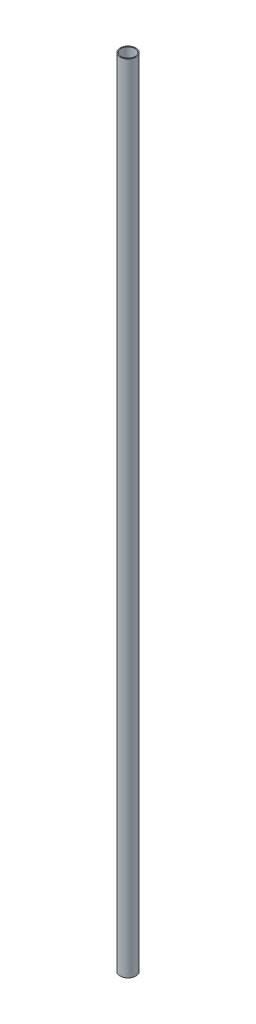
ISO-10303-21;
HEADER;
FILE_DESCRIPTION(('STEP AP214'),'2;1');
FILE_NAME('part.step','',(''),(''),'','','');
FILE_SCHEMA(('AUTOMOTIVE_DESIGN { 1 0 10303 214 1 1 1 1 }'));
ENDSEC;
DATA;
#1=APPLICATION_CONTEXT('core data for automotive mechanical design processes');
#2=APPLICATION_PROTOCOL_DEFINITION('international standard','automotive_design',2000,#1);
#3=PRODUCT_CONTEXT('',#1,'mechanical');
#4=PRODUCT('Part','Part','',(#3));
#5=PRODUCT_RELATED_PRODUCT_CATEGORY('part','',(#4));
#6=PRODUCT_DEFINITION_FORMATION('','',#4);
#7=PRODUCT_DEFINITION_CONTEXT('part definition',#1,'design');
#8=PRODUCT_DEFINITION('design','',#6,#7);
#9=PRODUCT_DEFINITION_SHAPE('','',#8);
#10=(LENGTH_UNIT() NAMED_UNIT(*) SI_UNIT(.MILLI.,.METRE.));
#11=(NAMED_UNIT(*) PLANE_ANGLE_UNIT() SI_UNIT($,.RADIAN.));
#12=(NAMED_UNIT(*) SI_UNIT($,.STERADIAN.) SOLID_ANGLE_UNIT());
#13=UNCERTAINTY_MEASURE_WITH_UNIT(LENGTH_MEASURE(1.E-05),#10,'distance_accuracy_value','');
#14=(GEOMETRIC_REPRESENTATION_CONTEXT(3) GLOBAL_UNCERTAINTY_ASSIGNED_CONTEXT((#13)) GLOBAL_UNIT_ASSIGNED_CONTEXT((#10,
#11,#12)) REPRESENTATION_CONTEXT('',''));
#15=CARTESIAN_POINT('',(0.,0.,0.));
#16=DIRECTION('',(0.,0.,1.));
#17=DIRECTION('',(1.,0.,0.));
#18=AXIS2_PLACEMENT_3D('',#15,#16,#17);
#19=CARTESIAN_POINT('',(0.,400.,0.));
#20=DIRECTION('',(0.,1.,0.));
#21=DIRECTION('',(0.,0.,1.));
#22=AXIS2_PLACEMENT_3D('',#19,#20,#21);
#23=PLANE('',#22);
#24=CARTESIAN_POINT('',(0.,400.,0.));
#25=DIRECTION('',(0.,1.,0.));
#26=DIRECTION('',(0.,0.,1.));
#27=AXIS2_PLACEMENT_3D('',#24,#25,#26);
#28=CIRCLE('',#27,4.);
#29=CARTESIAN_POINT('',(0.,400.,4.));
#30=VERTEX_POINT('',#29);
#31=EDGE_CURVE('E10',#30,#30,#28,.T.);
#32=ORIENTED_EDGE('',*,*,#31,.T.);
#33=EDGE_LOOP('',(#32));
#34=FACE_BOUND('',#33,.T.);
#35=CARTESIAN_POINT('',(0.,400.,0.));
#36=DIRECTION('',(0.,1.,0.));
#37=DIRECTION('',(0.,0.,1.));
#38=AXIS2_PLACEMENT_3D('',#35,#36,#37);
#39=CIRCLE('',#38,3.5);
#40=CARTESIAN_POINT('',(0.,400.,3.5));
#41=VERTEX_POINT('',#40);
#42=EDGE_CURVE('E46',#41,#41,#39,.T.);
#43=ORIENTED_EDGE('',*,*,#42,.F.);
#44=EDGE_LOOP('',(#43));
#45=FACE_BOUND('',#44,.T.);
#46=ADVANCED_FACE('F35',(#34,#45),#23,.T.);
#47=CARTESIAN_POINT('',(0.,0.,0.));
#48=DIRECTION('',(0.,1.,0.));
#49=DIRECTION('',(0.,0.,1.));
#50=AXIS2_PLACEMENT_3D('',#47,#48,#49);
#51=PLANE('',#50);
#52=CARTESIAN_POINT('',(0.,0.,0.));
#53=DIRECTION('',(0.,1.,0.));
#54=DIRECTION('',(0.,0.,1.));
#55=AXIS2_PLACEMENT_3D('',#52,#53,#54);
#56=CIRCLE('',#55,4.);
#57=CARTESIAN_POINT('',(0.,0.,4.));
#58=VERTEX_POINT('',#57);
#59=EDGE_CURVE('E39',#58,#58,#56,.T.);
#60=ORIENTED_EDGE('',*,*,#59,.F.);
#61=EDGE_LOOP('',(#60));
#62=FACE_BOUND('',#61,.T.);
#63=CARTESIAN_POINT('',(0.,0.,0.));
#64=DIRECTION('',(0.,1.,0.));
#65=DIRECTION('',(0.,0.,1.));
#66=AXIS2_PLACEMENT_3D('',#63,#64,#65);
#67=CIRCLE('',#66,3.5);
#68=CARTESIAN_POINT('',(0.,0.,3.5));
#69=VERTEX_POINT('',#68);
#70=EDGE_CURVE('E48',#69,#69,#67,.T.);
#71=ORIENTED_EDGE('',*,*,#70,.T.);
#72=EDGE_LOOP('',(#71));
#73=FACE_BOUND('',#72,.T.);
#74=ADVANCED_FACE('F58',(#62,#73),#51,.F.);
#75=CARTESIAN_POINT('',(0.,400.,0.));
#76=DIRECTION('',(0.,-1.,0.));
#77=DIRECTION('',(0.,0.,-1.));
#78=AXIS2_PLACEMENT_3D('',#75,#76,#77);
#79=CYLINDRICAL_SURFACE('',#78,4.);
#80=ORIENTED_EDGE('',*,*,#31,.F.);
#81=EDGE_LOOP('',(#80));
#82=FACE_BOUND('',#81,.T.);
#83=ORIENTED_EDGE('',*,*,#59,.T.);
#84=EDGE_LOOP('',(#83));
#85=FACE_BOUND('',#84,.T.);
#86=ADVANCED_FACE('F37',(#82,#85),#79,.T.);
#87=CARTESIAN_POINT('',(0.,400.,0.));
#88=DIRECTION('',(0.,-1.,0.));
#89=DIRECTION('',(0.,0.,-1.));
#90=AXIS2_PLACEMENT_3D('',#87,#88,#89);
#91=CYLINDRICAL_SURFACE('',#90,3.5);
#92=ORIENTED_EDGE('',*,*,#42,.T.);
#93=EDGE_LOOP('',(#92));
#94=FACE_BOUND('',#93,.T.);
#95=ORIENTED_EDGE('',*,*,#70,.F.);
#96=EDGE_LOOP('',(#95));
#97=FACE_BOUND('',#96,.T.);
#98=ADVANCED_FACE('F54',(#94,#97),#91,.F.);
#99=CLOSED_SHELL('',(#46,#74,#86,#98));
#100=MANIFOLD_SOLID_BREP('B2',#99);
#101=ADVANCED_BREP_SHAPE_REPRESENTATION('',(#18,#100),#14);
#102=SHAPE_DEFINITION_REPRESENTATION(#9,#101);
ENDSEC;
END-ISO-10303-21;
